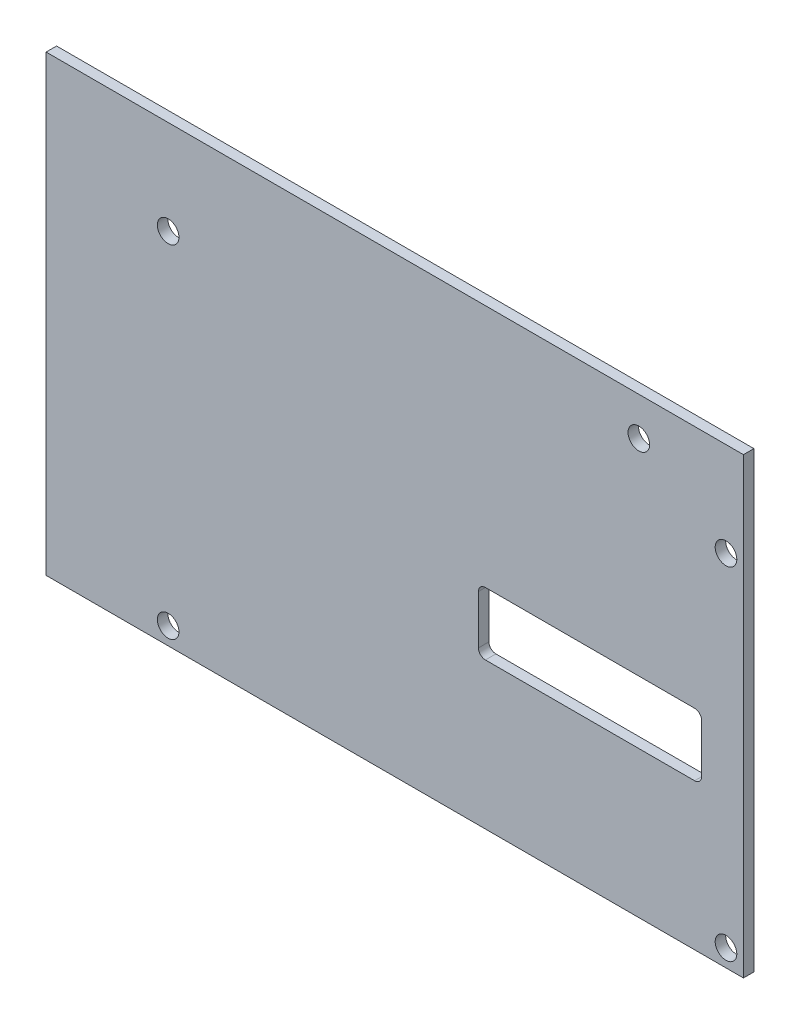
ISO-10303-21;
HEADER;
FILE_DESCRIPTION(('STEP AP214'),'2;1');
FILE_NAME('part.step','',(''),(''),'','','');
FILE_SCHEMA(('AUTOMOTIVE_DESIGN { 1 0 10303 214 1 1 1 1 }'));
ENDSEC;
DATA;
#1=APPLICATION_CONTEXT('core data for automotive mechanical design processes');
#2=APPLICATION_PROTOCOL_DEFINITION('international standard','automotive_design',2000,#1);
#3=PRODUCT_CONTEXT('',#1,'mechanical');
#4=PRODUCT('Part','Part','',(#3));
#5=PRODUCT_RELATED_PRODUCT_CATEGORY('part','',(#4));
#6=PRODUCT_DEFINITION_FORMATION('','',#4);
#7=PRODUCT_DEFINITION_CONTEXT('part definition',#1,'design');
#8=PRODUCT_DEFINITION('design','',#6,#7);
#9=PRODUCT_DEFINITION_SHAPE('','',#8);
#10=(LENGTH_UNIT() NAMED_UNIT(*) SI_UNIT(.MILLI.,.METRE.));
#11=(NAMED_UNIT(*) PLANE_ANGLE_UNIT() SI_UNIT($,.RADIAN.));
#12=(NAMED_UNIT(*) SI_UNIT($,.STERADIAN.) SOLID_ANGLE_UNIT());
#13=UNCERTAINTY_MEASURE_WITH_UNIT(LENGTH_MEASURE(1.E-05),#10,'distance_accuracy_value','');
#14=(GEOMETRIC_REPRESENTATION_CONTEXT(3) GLOBAL_UNCERTAINTY_ASSIGNED_CONTEXT((#13)) GLOBAL_UNIT_ASSIGNED_CONTEXT((#10,
#11,#12)) REPRESENTATION_CONTEXT('',''));
#15=CARTESIAN_POINT('',(0.,0.,0.));
#16=DIRECTION('',(0.,0.,1.));
#17=DIRECTION('',(1.,0.,0.));
#18=AXIS2_PLACEMENT_3D('',#15,#16,#17);
#19=CARTESIAN_POINT('',(0.,65.,1.5));
#20=DIRECTION('',(0.,0.,-1.));
#21=DIRECTION('',(-1.,0.,0.));
#22=AXIS2_PLACEMENT_3D('',#19,#20,#21);
#23=PLANE('',#22);
#24=CARTESIAN_POINT('',(17.5,2.5,1.5));
#25=DIRECTION('',(0.,0.,1.));
#26=DIRECTION('',(1.,0.,0.));
#27=AXIS2_PLACEMENT_3D('',#24,#25,#26);
#28=CIRCLE('',#27,1.55);
#29=CARTESIAN_POINT('',(19.05,2.5,1.5));
#30=VERTEX_POINT('',#29);
#31=EDGE_CURVE('E185',#30,#30,#28,.T.);
#32=ORIENTED_EDGE('',*,*,#31,.F.);
#33=EDGE_LOOP('',(#32));
#34=FACE_BOUND('',#33,.T.);
#35=CARTESIAN_POINT('',(97.5,51.5,1.5));
#36=DIRECTION('',(0.,0.,1.));
#37=DIRECTION('',(1.,0.,0.));
#38=AXIS2_PLACEMENT_3D('',#35,#36,#37);
#39=CIRCLE('',#38,1.54999999999999);
#40=CARTESIAN_POINT('',(99.05,51.5,1.5));
#41=VERTEX_POINT('',#40);
#42=EDGE_CURVE('E197',#41,#41,#39,.T.);
#43=ORIENTED_EDGE('',*,*,#42,.F.);
#44=EDGE_LOOP('',(#43));
#45=FACE_BOUND('',#44,.T.);
#46=CARTESIAN_POINT('',(85.,59.5,1.5));
#47=DIRECTION('',(0.,0.,1.));
#48=DIRECTION('',(1.,0.,0.));
#49=AXIS2_PLACEMENT_3D('',#46,#47,#48);
#50=CIRCLE('',#49,1.54999999999999);
#51=CARTESIAN_POINT('',(86.55,59.5,1.5));
#52=VERTEX_POINT('',#51);
#53=EDGE_CURVE('E209',#52,#52,#50,.T.);
#54=ORIENTED_EDGE('',*,*,#53,.F.);
#55=EDGE_LOOP('',(#54));
#56=FACE_BOUND('',#55,.T.);
#57=DIRECTION('',(0.,-1.,0.));
#58=VECTOR('',#57,1.);
#59=CARTESIAN_POINT('',(0.,0.,1.5));
#60=LINE('',#59,#58);
#61=CARTESIAN_POINT('',(0.,65.,1.5));
#62=VERTEX_POINT('',#61);
#63=CARTESIAN_POINT('',(0.,0.,1.5));
#64=VERTEX_POINT('',#63);
#65=EDGE_CURVE('E215',#62,#64,#60,.T.);
#66=ORIENTED_EDGE('',*,*,#65,.T.);
#67=DIRECTION('',(1.,0.,0.));
#68=VECTOR('',#67,1.);
#69=CARTESIAN_POINT('',(0.,0.,1.5));
#70=LINE('',#69,#68);
#71=CARTESIAN_POINT('',(100.,0.,1.5));
#72=VERTEX_POINT('',#71);
#73=EDGE_CURVE('E218',#64,#72,#70,.T.);
#74=ORIENTED_EDGE('',*,*,#73,.T.);
#75=DIRECTION('',(0.,1.,0.));
#76=VECTOR('',#75,1.);
#77=CARTESIAN_POINT('',(100.,0.,1.5));
#78=LINE('',#77,#76);
#79=CARTESIAN_POINT('',(100.,65.,1.5));
#80=VERTEX_POINT('',#79);
#81=EDGE_CURVE('E221',#72,#80,#78,.T.);
#82=ORIENTED_EDGE('',*,*,#81,.T.);
#83=DIRECTION('',(-1.,0.,0.));
#84=VECTOR('',#83,1.);
#85=CARTESIAN_POINT('',(0.,65.,1.5));
#86=LINE('',#85,#84);
#87=EDGE_CURVE('E223',#80,#62,#86,.T.);
#88=ORIENTED_EDGE('',*,*,#87,.T.);
#89=EDGE_LOOP('',(#66,#74,#82,#88));
#90=FACE_BOUND('',#89,.T.);
#91=CARTESIAN_POINT('',(17.5,51.5,1.5));
#92=DIRECTION('',(0.,0.,1.));
#93=DIRECTION('',(1.,0.,0.));
#94=AXIS2_PLACEMENT_3D('',#91,#92,#93);
#95=CIRCLE('',#94,1.55000000000001);
#96=CARTESIAN_POINT('',(19.05,51.5,1.5));
#97=VERTEX_POINT('',#96);
#98=EDGE_CURVE('E203',#97,#97,#95,.T.);
#99=ORIENTED_EDGE('',*,*,#98,.F.);
#100=EDGE_LOOP('',(#99));
#101=FACE_BOUND('',#100,.T.);
#102=CARTESIAN_POINT('',(97.5,2.5,1.5));
#103=DIRECTION('',(0.,0.,1.));
#104=DIRECTION('',(1.,0.,0.));
#105=AXIS2_PLACEMENT_3D('',#102,#103,#104);
#106=CIRCLE('',#105,1.54999999999999);
#107=CARTESIAN_POINT('',(99.05,2.5,1.5));
#108=VERTEX_POINT('',#107);
#109=EDGE_CURVE('E191',#108,#108,#106,.T.);
#110=ORIENTED_EDGE('',*,*,#109,.F.);
#111=EDGE_LOOP('',(#110));
#112=FACE_BOUND('',#111,.T.);
#113=CARTESIAN_POINT('',(63.,29.,1.5));
#114=DIRECTION('',(0.,0.,1.));
#115=DIRECTION('',(1.,0.,0.));
#116=AXIS2_PLACEMENT_3D('',#113,#114,#115);
#117=CIRCLE('',#116,1.);
#118=CARTESIAN_POINT('',(63.,30.,1.5));
#119=VERTEX_POINT('',#118);
#120=CARTESIAN_POINT('',(62.,29.,1.5));
#121=VERTEX_POINT('',#120);
#122=EDGE_CURVE('E120',#119,#121,#117,.T.);
#123=ORIENTED_EDGE('',*,*,#122,.F.);
#124=DIRECTION('',(-1.,0.,0.));
#125=VECTOR('',#124,1.);
#126=CARTESIAN_POINT('',(63.,30.,1.5));
#127=LINE('',#126,#125);
#128=CARTESIAN_POINT('',(93.,30.,1.5));
#129=VERTEX_POINT('',#128);
#130=EDGE_CURVE('E153',#129,#119,#127,.T.);
#131=ORIENTED_EDGE('',*,*,#130,.F.);
#132=CARTESIAN_POINT('',(93.,29.,1.5));
#133=DIRECTION('',(0.,0.,1.));
#134=DIRECTION('',(1.,0.,0.));
#135=AXIS2_PLACEMENT_3D('',#132,#133,#134);
#136=CIRCLE('',#135,1.);
#137=CARTESIAN_POINT('',(94.,29.,1.5));
#138=VERTEX_POINT('',#137);
#139=EDGE_CURVE('E151',#138,#129,#136,.T.);
#140=ORIENTED_EDGE('',*,*,#139,.F.);
#141=DIRECTION('',(0.,1.,0.));
#142=VECTOR('',#141,1.);
#143=CARTESIAN_POINT('',(94.,29.,1.5));
#144=LINE('',#143,#142);
#145=CARTESIAN_POINT('',(94.,22.,1.5));
#146=VERTEX_POINT('',#145);
#147=EDGE_CURVE('E149',#146,#138,#144,.T.);
#148=ORIENTED_EDGE('',*,*,#147,.F.);
#149=CARTESIAN_POINT('',(93.,22.,1.5));
#150=DIRECTION('',(0.,0.,1.));
#151=DIRECTION('',(-1.,0.,0.));
#152=AXIS2_PLACEMENT_3D('',#149,#150,#151);
#153=CIRCLE('',#152,1.);
#154=CARTESIAN_POINT('',(93.,21.,1.5));
#155=VERTEX_POINT('',#154);
#156=EDGE_CURVE('E147',#155,#146,#153,.T.);
#157=ORIENTED_EDGE('',*,*,#156,.F.);
#158=DIRECTION('',(1.,0.,0.));
#159=VECTOR('',#158,1.);
#160=CARTESIAN_POINT('',(63.,21.,1.5));
#161=LINE('',#160,#159);
#162=CARTESIAN_POINT('',(63.,21.,1.5));
#163=VERTEX_POINT('',#162);
#164=EDGE_CURVE('E143',#163,#155,#161,.T.);
#165=ORIENTED_EDGE('',*,*,#164,.F.);
#166=CARTESIAN_POINT('',(63.,22.,1.5));
#167=DIRECTION('',(0.,0.,1.));
#168=DIRECTION('',(-1.,0.,0.));
#169=AXIS2_PLACEMENT_3D('',#166,#167,#168);
#170=CIRCLE('',#169,0.999999999999999);
#171=CARTESIAN_POINT('',(62.,22.,1.5));
#172=VERTEX_POINT('',#171);
#173=EDGE_CURVE('E141',#172,#163,#170,.T.);
#174=ORIENTED_EDGE('',*,*,#173,.F.);
#175=DIRECTION('',(0.,-1.,0.));
#176=VECTOR('',#175,1.);
#177=CARTESIAN_POINT('',(62.,29.,1.5));
#178=LINE('',#177,#176);
#179=EDGE_CURVE('E128',#121,#172,#178,.T.);
#180=ORIENTED_EDGE('',*,*,#179,.F.);
#181=EDGE_LOOP('',(#123,#131,#140,#148,#157,#165,#174,#180));
#182=FACE_BOUND('',#181,.T.);
#183=ADVANCED_FACE('F31',(#34,#45,#56,#90,#101,#112,#182),#23,.F.);
#184=CARTESIAN_POINT('',(0.,65.,0.));
#185=DIRECTION('',(0.,0.,-1.));
#186=DIRECTION('',(-1.,0.,0.));
#187=AXIS2_PLACEMENT_3D('',#184,#185,#186);
#188=PLANE('',#187);
#189=CARTESIAN_POINT('',(17.5,2.5,0.));
#190=DIRECTION('',(0.,0.,1.));
#191=DIRECTION('',(1.,0.,0.));
#192=AXIS2_PLACEMENT_3D('',#189,#190,#191);
#193=CIRCLE('',#192,1.55);
#194=CARTESIAN_POINT('',(19.05,2.5,0.));
#195=VERTEX_POINT('',#194);
#196=EDGE_CURVE('E136',#195,#195,#193,.T.);
#197=ORIENTED_EDGE('',*,*,#196,.T.);
#198=EDGE_LOOP('',(#197));
#199=FACE_BOUND('',#198,.T.);
#200=CARTESIAN_POINT('',(97.5,51.5,0.));
#201=DIRECTION('',(0.,0.,1.));
#202=DIRECTION('',(1.,0.,0.));
#203=AXIS2_PLACEMENT_3D('',#200,#201,#202);
#204=CIRCLE('',#203,1.54999999999999);
#205=CARTESIAN_POINT('',(99.05,51.5,0.));
#206=VERTEX_POINT('',#205);
#207=EDGE_CURVE('E194',#206,#206,#204,.T.);
#208=ORIENTED_EDGE('',*,*,#207,.T.);
#209=EDGE_LOOP('',(#208));
#210=FACE_BOUND('',#209,.T.);
#211=CARTESIAN_POINT('',(85.,59.5,0.));
#212=DIRECTION('',(0.,0.,1.));
#213=DIRECTION('',(1.,0.,0.));
#214=AXIS2_PLACEMENT_3D('',#211,#212,#213);
#215=CIRCLE('',#214,1.54999999999999);
#216=CARTESIAN_POINT('',(86.55,59.5,0.));
#217=VERTEX_POINT('',#216);
#218=EDGE_CURVE('E206',#217,#217,#215,.T.);
#219=ORIENTED_EDGE('',*,*,#218,.T.);
#220=EDGE_LOOP('',(#219));
#221=FACE_BOUND('',#220,.T.);
#222=DIRECTION('',(0.,-1.,0.));
#223=VECTOR('',#222,1.);
#224=CARTESIAN_POINT('',(0.,0.,0.));
#225=LINE('',#224,#223);
#226=CARTESIAN_POINT('',(0.,65.,0.));
#227=VERTEX_POINT('',#226);
#228=CARTESIAN_POINT('',(0.,0.,0.));
#229=VERTEX_POINT('',#228);
#230=EDGE_CURVE('E212',#227,#229,#225,.T.);
#231=ORIENTED_EDGE('',*,*,#230,.F.);
#232=DIRECTION('',(-1.,0.,0.));
#233=VECTOR('',#232,1.);
#234=CARTESIAN_POINT('',(0.,65.,0.));
#235=LINE('',#234,#233);
#236=CARTESIAN_POINT('',(100.,65.,0.));
#237=VERTEX_POINT('',#236);
#238=EDGE_CURVE('E219',#237,#227,#235,.T.);
#239=ORIENTED_EDGE('',*,*,#238,.F.);
#240=DIRECTION('',(0.,1.,0.));
#241=VECTOR('',#240,1.);
#242=CARTESIAN_POINT('',(100.,0.,0.));
#243=LINE('',#242,#241);
#244=CARTESIAN_POINT('',(100.,0.,0.));
#245=VERTEX_POINT('',#244);
#246=EDGE_CURVE('E230',#245,#237,#243,.T.);
#247=ORIENTED_EDGE('',*,*,#246,.F.);
#248=DIRECTION('',(1.,0.,0.));
#249=VECTOR('',#248,1.);
#250=CARTESIAN_POINT('',(0.,0.,0.));
#251=LINE('',#250,#249);
#252=EDGE_CURVE('E228',#229,#245,#251,.T.);
#253=ORIENTED_EDGE('',*,*,#252,.F.);
#254=EDGE_LOOP('',(#231,#239,#247,#253));
#255=FACE_BOUND('',#254,.T.);
#256=CARTESIAN_POINT('',(17.5,51.5,0.));
#257=DIRECTION('',(0.,0.,1.));
#258=DIRECTION('',(1.,0.,0.));
#259=AXIS2_PLACEMENT_3D('',#256,#257,#258);
#260=CIRCLE('',#259,1.55000000000001);
#261=CARTESIAN_POINT('',(19.05,51.5,0.));
#262=VERTEX_POINT('',#261);
#263=EDGE_CURVE('E200',#262,#262,#260,.T.);
#264=ORIENTED_EDGE('',*,*,#263,.T.);
#265=EDGE_LOOP('',(#264));
#266=FACE_BOUND('',#265,.T.);
#267=CARTESIAN_POINT('',(97.5,2.5,0.));
#268=DIRECTION('',(0.,0.,1.));
#269=DIRECTION('',(1.,0.,0.));
#270=AXIS2_PLACEMENT_3D('',#267,#268,#269);
#271=CIRCLE('',#270,1.54999999999999);
#272=CARTESIAN_POINT('',(99.05,2.5,0.));
#273=VERTEX_POINT('',#272);
#274=EDGE_CURVE('E188',#273,#273,#271,.T.);
#275=ORIENTED_EDGE('',*,*,#274,.T.);
#276=EDGE_LOOP('',(#275));
#277=FACE_BOUND('',#276,.T.);
#278=DIRECTION('',(-1.,0.,0.));
#279=VECTOR('',#278,1.);
#280=CARTESIAN_POINT('',(63.,30.,0.));
#281=LINE('',#280,#279);
#282=CARTESIAN_POINT('',(93.,30.,0.));
#283=VERTEX_POINT('',#282);
#284=CARTESIAN_POINT('',(63.,30.,0.));
#285=VERTEX_POINT('',#284);
#286=EDGE_CURVE('E129',#283,#285,#281,.T.);
#287=ORIENTED_EDGE('',*,*,#286,.T.);
#288=CARTESIAN_POINT('',(63.,29.,0.));
#289=DIRECTION('',(0.,0.,1.));
#290=DIRECTION('',(1.,0.,0.));
#291=AXIS2_PLACEMENT_3D('',#288,#289,#290);
#292=CIRCLE('',#291,1.);
#293=CARTESIAN_POINT('',(62.,29.,0.));
#294=VERTEX_POINT('',#293);
#295=EDGE_CURVE('E54',#285,#294,#292,.T.);
#296=ORIENTED_EDGE('',*,*,#295,.T.);
#297=DIRECTION('',(0.,-1.,0.));
#298=VECTOR('',#297,1.);
#299=CARTESIAN_POINT('',(62.,29.,0.));
#300=LINE('',#299,#298);
#301=CARTESIAN_POINT('',(62.,22.,0.));
#302=VERTEX_POINT('',#301);
#303=EDGE_CURVE('E135',#294,#302,#300,.T.);
#304=ORIENTED_EDGE('',*,*,#303,.T.);
#305=CARTESIAN_POINT('',(63.,22.,0.));
#306=DIRECTION('',(0.,0.,1.));
#307=DIRECTION('',(-1.,0.,0.));
#308=AXIS2_PLACEMENT_3D('',#305,#306,#307);
#309=CIRCLE('',#308,0.999999999999999);
#310=CARTESIAN_POINT('',(63.,21.,0.));
#311=VERTEX_POINT('',#310);
#312=EDGE_CURVE('E157',#302,#311,#309,.T.);
#313=ORIENTED_EDGE('',*,*,#312,.T.);
#314=DIRECTION('',(1.,0.,0.));
#315=VECTOR('',#314,1.);
#316=CARTESIAN_POINT('',(63.,21.,0.));
#317=LINE('',#316,#315);
#318=CARTESIAN_POINT('',(93.,21.,0.));
#319=VERTEX_POINT('',#318);
#320=EDGE_CURVE('E160',#311,#319,#317,.T.);
#321=ORIENTED_EDGE('',*,*,#320,.T.);
#322=CARTESIAN_POINT('',(93.,22.,0.));
#323=DIRECTION('',(0.,0.,1.));
#324=DIRECTION('',(-1.,0.,0.));
#325=AXIS2_PLACEMENT_3D('',#322,#323,#324);
#326=CIRCLE('',#325,1.);
#327=CARTESIAN_POINT('',(94.,22.,0.));
#328=VERTEX_POINT('',#327);
#329=EDGE_CURVE('E163',#319,#328,#326,.T.);
#330=ORIENTED_EDGE('',*,*,#329,.T.);
#331=DIRECTION('',(0.,1.,0.));
#332=VECTOR('',#331,1.);
#333=CARTESIAN_POINT('',(94.,29.,0.));
#334=LINE('',#333,#332);
#335=CARTESIAN_POINT('',(94.,29.,0.));
#336=VERTEX_POINT('',#335);
#337=EDGE_CURVE('E166',#328,#336,#334,.T.);
#338=ORIENTED_EDGE('',*,*,#337,.T.);
#339=CARTESIAN_POINT('',(93.,29.,0.));
#340=DIRECTION('',(0.,0.,1.));
#341=DIRECTION('',(1.,0.,0.));
#342=AXIS2_PLACEMENT_3D('',#339,#340,#341);
#343=CIRCLE('',#342,1.);
#344=EDGE_CURVE('E169',#336,#283,#343,.T.);
#345=ORIENTED_EDGE('',*,*,#344,.T.);
#346=EDGE_LOOP('',(#287,#296,#304,#313,#321,#330,#338,#345));
#347=FACE_BOUND('',#346,.T.);
#348=ADVANCED_FACE('F248',(#199,#210,#221,#255,#266,#277,#347),#188,.T.);
#349=CARTESIAN_POINT('',(0.,0.,1.5));
#350=DIRECTION('',(1.,0.,0.));
#351=DIRECTION('',(0.,1.,0.));
#352=AXIS2_PLACEMENT_3D('',#349,#350,#351);
#353=PLANE('',#352);
#354=ORIENTED_EDGE('',*,*,#230,.T.);
#355=DIRECTION('',(0.,0.,-1.));
#356=VECTOR('',#355,1.);
#357=CARTESIAN_POINT('',(0.,0.,1.5));
#358=LINE('',#357,#356);
#359=EDGE_CURVE('E11',#64,#229,#358,.T.);
#360=ORIENTED_EDGE('',*,*,#359,.F.);
#361=ORIENTED_EDGE('',*,*,#65,.F.);
#362=DIRECTION('',(0.,0.,-1.));
#363=VECTOR('',#362,1.);
#364=CARTESIAN_POINT('',(0.,65.,1.5));
#365=LINE('',#364,#363);
#366=EDGE_CURVE('E225',#62,#227,#365,.T.);
#367=ORIENTED_EDGE('',*,*,#366,.T.);
#368=EDGE_LOOP('',(#354,#360,#361,#367));
#369=FACE_BOUND('',#368,.T.);
#370=ADVANCED_FACE('F33',(#369),#353,.F.);
#371=CARTESIAN_POINT('',(0.,0.,1.5));
#372=DIRECTION('',(0.,1.,0.));
#373=DIRECTION('',(0.,0.,1.));
#374=AXIS2_PLACEMENT_3D('',#371,#372,#373);
#375=PLANE('',#374);
#376=ORIENTED_EDGE('',*,*,#252,.T.);
#377=DIRECTION('',(0.,0.,-1.));
#378=VECTOR('',#377,1.);
#379=CARTESIAN_POINT('',(100.,0.,1.5));
#380=LINE('',#379,#378);
#381=EDGE_CURVE('E39',#72,#245,#380,.T.);
#382=ORIENTED_EDGE('',*,*,#381,.F.);
#383=ORIENTED_EDGE('',*,*,#73,.F.);
#384=ORIENTED_EDGE('',*,*,#359,.T.);
#385=EDGE_LOOP('',(#376,#382,#383,#384));
#386=FACE_BOUND('',#385,.T.);
#387=ADVANCED_FACE('F259',(#386),#375,.F.);
#388=CARTESIAN_POINT('',(100.,0.,1.5));
#389=DIRECTION('',(-1.,0.,0.));
#390=DIRECTION('',(0.,0.,1.));
#391=AXIS2_PLACEMENT_3D('',#388,#389,#390);
#392=PLANE('',#391);
#393=ORIENTED_EDGE('',*,*,#246,.T.);
#394=DIRECTION('',(0.,0.,-1.));
#395=VECTOR('',#394,1.);
#396=CARTESIAN_POINT('',(100.,65.,1.5));
#397=LINE('',#396,#395);
#398=EDGE_CURVE('E235',#80,#237,#397,.T.);
#399=ORIENTED_EDGE('',*,*,#398,.F.);
#400=ORIENTED_EDGE('',*,*,#81,.F.);
#401=ORIENTED_EDGE('',*,*,#381,.T.);
#402=EDGE_LOOP('',(#393,#399,#400,#401));
#403=FACE_BOUND('',#402,.T.);
#404=ADVANCED_FACE('F242',(#403),#392,.F.);
#405=CARTESIAN_POINT('',(0.,65.,1.5));
#406=DIRECTION('',(0.,-1.,0.));
#407=DIRECTION('',(0.,0.,-1.));
#408=AXIS2_PLACEMENT_3D('',#405,#406,#407);
#409=PLANE('',#408);
#410=ORIENTED_EDGE('',*,*,#238,.T.);
#411=ORIENTED_EDGE('',*,*,#366,.F.);
#412=ORIENTED_EDGE('',*,*,#87,.F.);
#413=ORIENTED_EDGE('',*,*,#398,.T.);
#414=EDGE_LOOP('',(#410,#411,#412,#413));
#415=FACE_BOUND('',#414,.T.);
#416=ADVANCED_FACE('F252',(#415),#409,.F.);
#417=CARTESIAN_POINT('',(85.,59.5,1.5));
#418=DIRECTION('',(0.,0.,-1.));
#419=DIRECTION('',(-1.,0.,0.));
#420=AXIS2_PLACEMENT_3D('',#417,#418,#419);
#421=CYLINDRICAL_SURFACE('',#420,1.54999999999999);
#422=ORIENTED_EDGE('',*,*,#53,.T.);
#423=EDGE_LOOP('',(#422));
#424=FACE_BOUND('',#423,.T.);
#425=ORIENTED_EDGE('',*,*,#218,.F.);
#426=EDGE_LOOP('',(#425));
#427=FACE_BOUND('',#426,.T.);
#428=ADVANCED_FACE('F277',(#424,#427),#421,.F.);
#429=CARTESIAN_POINT('',(17.5,51.5,1.5));
#430=DIRECTION('',(0.,0.,-1.));
#431=DIRECTION('',(-1.,0.,0.));
#432=AXIS2_PLACEMENT_3D('',#429,#430,#431);
#433=CYLINDRICAL_SURFACE('',#432,1.55000000000001);
#434=ORIENTED_EDGE('',*,*,#98,.T.);
#435=EDGE_LOOP('',(#434));
#436=FACE_BOUND('',#435,.T.);
#437=ORIENTED_EDGE('',*,*,#263,.F.);
#438=EDGE_LOOP('',(#437));
#439=FACE_BOUND('',#438,.T.);
#440=ADVANCED_FACE('F284',(#436,#439),#433,.F.);
#441=CARTESIAN_POINT('',(97.5,51.5,1.5));
#442=DIRECTION('',(0.,0.,-1.));
#443=DIRECTION('',(-1.,0.,0.));
#444=AXIS2_PLACEMENT_3D('',#441,#442,#443);
#445=CYLINDRICAL_SURFACE('',#444,1.54999999999999);
#446=ORIENTED_EDGE('',*,*,#42,.T.);
#447=EDGE_LOOP('',(#446));
#448=FACE_BOUND('',#447,.T.);
#449=ORIENTED_EDGE('',*,*,#207,.F.);
#450=EDGE_LOOP('',(#449));
#451=FACE_BOUND('',#450,.T.);
#452=ADVANCED_FACE('F289',(#448,#451),#445,.F.);
#453=CARTESIAN_POINT('',(97.5,2.5,1.5));
#454=DIRECTION('',(0.,0.,-1.));
#455=DIRECTION('',(-1.,0.,0.));
#456=AXIS2_PLACEMENT_3D('',#453,#454,#455);
#457=CYLINDRICAL_SURFACE('',#456,1.54999999999999);
#458=ORIENTED_EDGE('',*,*,#109,.T.);
#459=EDGE_LOOP('',(#458));
#460=FACE_BOUND('',#459,.T.);
#461=ORIENTED_EDGE('',*,*,#274,.F.);
#462=EDGE_LOOP('',(#461));
#463=FACE_BOUND('',#462,.T.);
#464=ADVANCED_FACE('F299',(#460,#463),#457,.F.);
#465=CARTESIAN_POINT('',(17.5,2.5,1.5));
#466=DIRECTION('',(0.,0.,-1.));
#467=DIRECTION('',(-1.,0.,0.));
#468=AXIS2_PLACEMENT_3D('',#465,#466,#467);
#469=CYLINDRICAL_SURFACE('',#468,1.55);
#470=ORIENTED_EDGE('',*,*,#31,.T.);
#471=EDGE_LOOP('',(#470));
#472=FACE_BOUND('',#471,.T.);
#473=ORIENTED_EDGE('',*,*,#196,.F.);
#474=EDGE_LOOP('',(#473));
#475=FACE_BOUND('',#474,.T.);
#476=ADVANCED_FACE('F306',(#472,#475),#469,.F.);
#477=CARTESIAN_POINT('',(63.,29.,1.5));
#478=DIRECTION('',(0.,0.,-1.));
#479=DIRECTION('',(-1.,0.,0.));
#480=AXIS2_PLACEMENT_3D('',#477,#478,#479);
#481=CYLINDRICAL_SURFACE('',#480,1.);
#482=ORIENTED_EDGE('',*,*,#295,.F.);
#483=DIRECTION('',(0.,0.,-1.));
#484=VECTOR('',#483,1.);
#485=CARTESIAN_POINT('',(63.,30.,1.5));
#486=LINE('',#485,#484);
#487=EDGE_CURVE('E124',#119,#285,#486,.T.);
#488=ORIENTED_EDGE('',*,*,#487,.F.);
#489=ORIENTED_EDGE('',*,*,#122,.T.);
#490=DIRECTION('',(0.,0.,-1.));
#491=VECTOR('',#490,1.);
#492=CARTESIAN_POINT('',(62.,29.,1.5));
#493=LINE('',#492,#491);
#494=EDGE_CURVE('E123',#121,#294,#493,.T.);
#495=ORIENTED_EDGE('',*,*,#494,.T.);
#496=EDGE_LOOP('',(#482,#488,#489,#495));
#497=FACE_BOUND('',#496,.T.);
#498=ADVANCED_FACE('F122',(#497),#481,.F.);
#499=CARTESIAN_POINT('',(62.,29.,1.5));
#500=DIRECTION('',(1.,0.,0.));
#501=DIRECTION('',(0.,1.,0.));
#502=AXIS2_PLACEMENT_3D('',#499,#500,#501);
#503=PLANE('',#502);
#504=ORIENTED_EDGE('',*,*,#303,.F.);
#505=ORIENTED_EDGE('',*,*,#494,.F.);
#506=ORIENTED_EDGE('',*,*,#179,.T.);
#507=DIRECTION('',(0.,0.,-1.));
#508=VECTOR('',#507,1.);
#509=CARTESIAN_POINT('',(62.,22.,1.5));
#510=LINE('',#509,#508);
#511=EDGE_CURVE('E137',#172,#302,#510,.T.);
#512=ORIENTED_EDGE('',*,*,#511,.T.);
#513=EDGE_LOOP('',(#504,#505,#506,#512));
#514=FACE_BOUND('',#513,.T.);
#515=ADVANCED_FACE('F132',(#514),#503,.T.);
#516=CARTESIAN_POINT('',(63.,22.,1.5));
#517=DIRECTION('',(0.,0.,-1.));
#518=DIRECTION('',(-1.,0.,0.));
#519=AXIS2_PLACEMENT_3D('',#516,#517,#518);
#520=CYLINDRICAL_SURFACE('',#519,0.999999999999999);
#521=ORIENTED_EDGE('',*,*,#312,.F.);
#522=ORIENTED_EDGE('',*,*,#511,.F.);
#523=ORIENTED_EDGE('',*,*,#173,.T.);
#524=DIRECTION('',(0.,0.,-1.));
#525=VECTOR('',#524,1.);
#526=CARTESIAN_POINT('',(63.,21.,1.5));
#527=LINE('',#526,#525);
#528=EDGE_CURVE('E182',#163,#311,#527,.T.);
#529=ORIENTED_EDGE('',*,*,#528,.T.);
#530=EDGE_LOOP('',(#521,#522,#523,#529));
#531=FACE_BOUND('',#530,.T.);
#532=ADVANCED_FACE('F315',(#531),#520,.F.);
#533=CARTESIAN_POINT('',(63.,21.,1.5));
#534=DIRECTION('',(0.,1.,0.));
#535=DIRECTION('',(-1.,0.,0.));
#536=AXIS2_PLACEMENT_3D('',#533,#534,#535);
#537=PLANE('',#536);
#538=ORIENTED_EDGE('',*,*,#320,.F.);
#539=ORIENTED_EDGE('',*,*,#528,.F.);
#540=ORIENTED_EDGE('',*,*,#164,.T.);
#541=DIRECTION('',(0.,0.,-1.));
#542=VECTOR('',#541,1.);
#543=CARTESIAN_POINT('',(93.,21.,1.5));
#544=LINE('',#543,#542);
#545=EDGE_CURVE('E180',#155,#319,#544,.T.);
#546=ORIENTED_EDGE('',*,*,#545,.T.);
#547=EDGE_LOOP('',(#538,#539,#540,#546));
#548=FACE_BOUND('',#547,.T.);
#549=ADVANCED_FACE('F318',(#548),#537,.T.);
#550=CARTESIAN_POINT('',(93.,22.,1.5));
#551=DIRECTION('',(0.,0.,-1.));
#552=DIRECTION('',(-1.,0.,0.));
#553=AXIS2_PLACEMENT_3D('',#550,#551,#552);
#554=CYLINDRICAL_SURFACE('',#553,1.);
#555=ORIENTED_EDGE('',*,*,#329,.F.);
#556=ORIENTED_EDGE('',*,*,#545,.F.);
#557=ORIENTED_EDGE('',*,*,#156,.T.);
#558=DIRECTION('',(0.,0.,-1.));
#559=VECTOR('',#558,1.);
#560=CARTESIAN_POINT('',(94.,22.,1.5));
#561=LINE('',#560,#559);
#562=EDGE_CURVE('E178',#146,#328,#561,.T.);
#563=ORIENTED_EDGE('',*,*,#562,.T.);
#564=EDGE_LOOP('',(#555,#556,#557,#563));
#565=FACE_BOUND('',#564,.T.);
#566=ADVANCED_FACE('F322',(#565),#554,.F.);
#567=CARTESIAN_POINT('',(94.,29.,1.5));
#568=DIRECTION('',(-1.,0.,0.));
#569=DIRECTION('',(0.,0.,1.));
#570=AXIS2_PLACEMENT_3D('',#567,#568,#569);
#571=PLANE('',#570);
#572=ORIENTED_EDGE('',*,*,#337,.F.);
#573=ORIENTED_EDGE('',*,*,#562,.F.);
#574=ORIENTED_EDGE('',*,*,#147,.T.);
#575=DIRECTION('',(0.,0.,-1.));
#576=VECTOR('',#575,1.);
#577=CARTESIAN_POINT('',(94.,29.,1.5));
#578=LINE('',#577,#576);
#579=EDGE_CURVE('E176',#138,#336,#578,.T.);
#580=ORIENTED_EDGE('',*,*,#579,.T.);
#581=EDGE_LOOP('',(#572,#573,#574,#580));
#582=FACE_BOUND('',#581,.T.);
#583=ADVANCED_FACE('F326',(#582),#571,.T.);
#584=CARTESIAN_POINT('',(93.,29.,1.5));
#585=DIRECTION('',(0.,0.,-1.));
#586=DIRECTION('',(-1.,0.,0.));
#587=AXIS2_PLACEMENT_3D('',#584,#585,#586);
#588=CYLINDRICAL_SURFACE('',#587,1.);
#589=ORIENTED_EDGE('',*,*,#344,.F.);
#590=ORIENTED_EDGE('',*,*,#579,.F.);
#591=ORIENTED_EDGE('',*,*,#139,.T.);
#592=DIRECTION('',(0.,0.,-1.));
#593=VECTOR('',#592,1.);
#594=CARTESIAN_POINT('',(93.,30.,1.5));
#595=LINE('',#594,#593);
#596=EDGE_CURVE('E46',#129,#283,#595,.T.);
#597=ORIENTED_EDGE('',*,*,#596,.T.);
#598=EDGE_LOOP('',(#589,#590,#591,#597));
#599=FACE_BOUND('',#598,.T.);
#600=ADVANCED_FACE('F330',(#599),#588,.F.);
#601=CARTESIAN_POINT('',(63.,30.,1.5));
#602=DIRECTION('',(0.,-1.,0.));
#603=DIRECTION('',(0.,0.,-1.));
#604=AXIS2_PLACEMENT_3D('',#601,#602,#603);
#605=PLANE('',#604);
#606=ORIENTED_EDGE('',*,*,#286,.F.);
#607=ORIENTED_EDGE('',*,*,#596,.F.);
#608=ORIENTED_EDGE('',*,*,#130,.T.);
#609=ORIENTED_EDGE('',*,*,#487,.T.);
#610=EDGE_LOOP('',(#606,#607,#608,#609));
#611=FACE_BOUND('',#610,.T.);
#612=ADVANCED_FACE('F334',(#611),#605,.T.);
#613=CLOSED_SHELL('',(#183,#348,#370,#387,#404,#416,#428,#440,#452,#464,#476,#498,#515,#532,
#549,#566,#583,#600,#612));
#614=MANIFOLD_SOLID_BREP('B2',#613);
#615=ADVANCED_BREP_SHAPE_REPRESENTATION('',(#18,#614),#14);
#616=SHAPE_DEFINITION_REPRESENTATION(#9,#615);
ENDSEC;
END-ISO-10303-21;
